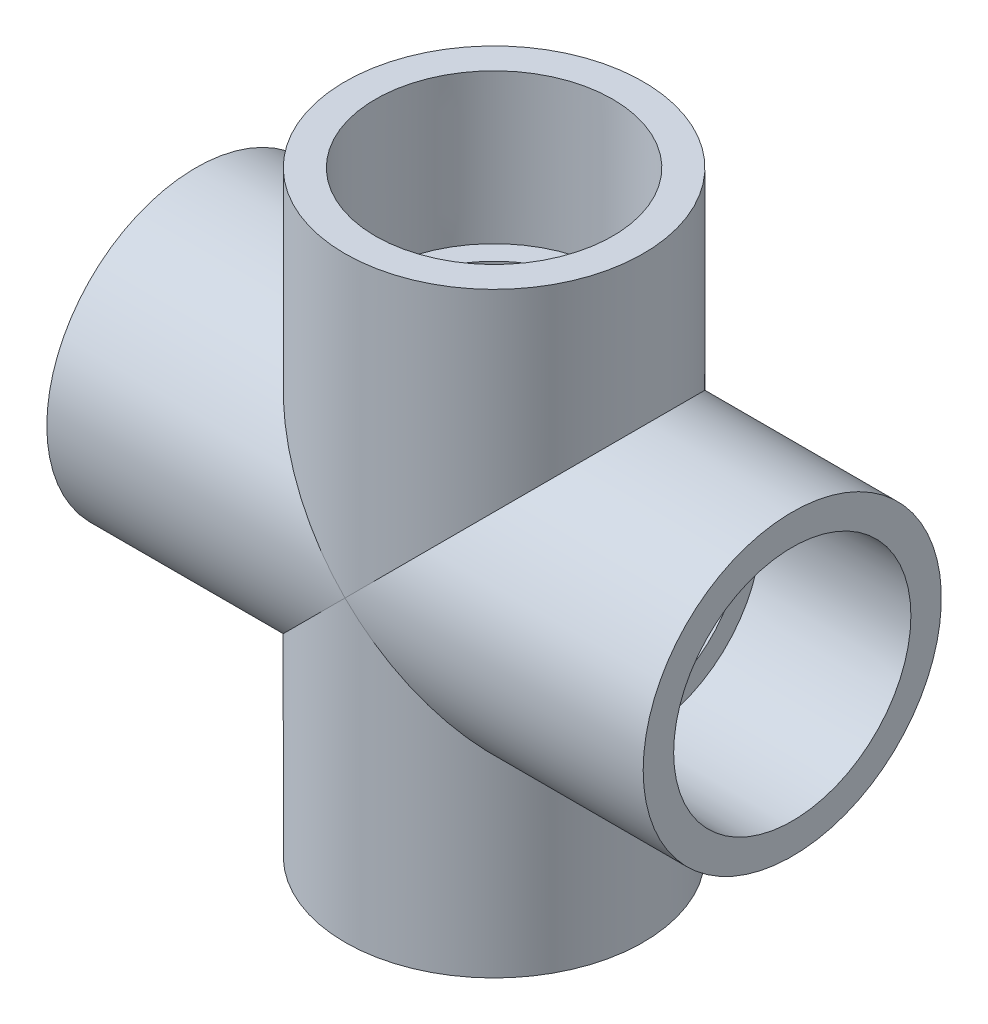
ISO-10303-21;
HEADER;
FILE_DESCRIPTION(('STEP AP214'),'2;1');
FILE_NAME('part.step','',(''),(''),'','','');
FILE_SCHEMA(('AUTOMOTIVE_DESIGN { 1 0 10303 214 1 1 1 1 }'));
ENDSEC;
DATA;
#1=APPLICATION_CONTEXT('core data for automotive mechanical design processes');
#2=APPLICATION_PROTOCOL_DEFINITION('international standard','automotive_design',2000,#1);
#3=PRODUCT_CONTEXT('',#1,'mechanical');
#4=PRODUCT('Part','Part','',(#3));
#5=PRODUCT_RELATED_PRODUCT_CATEGORY('part','',(#4));
#6=PRODUCT_DEFINITION_FORMATION('','',#4);
#7=PRODUCT_DEFINITION_CONTEXT('part definition',#1,'design');
#8=PRODUCT_DEFINITION('design','',#6,#7);
#9=PRODUCT_DEFINITION_SHAPE('','',#8);
#10=(LENGTH_UNIT() NAMED_UNIT(*) SI_UNIT(.MILLI.,.METRE.));
#11=(NAMED_UNIT(*) PLANE_ANGLE_UNIT() SI_UNIT($,.RADIAN.));
#12=(NAMED_UNIT(*) SI_UNIT($,.STERADIAN.) SOLID_ANGLE_UNIT());
#13=UNCERTAINTY_MEASURE_WITH_UNIT(LENGTH_MEASURE(1.E-05),#10,'distance_accuracy_value','');
#14=(GEOMETRIC_REPRESENTATION_CONTEXT(3) GLOBAL_UNCERTAINTY_ASSIGNED_CONTEXT((#13)) GLOBAL_UNIT_ASSIGNED_CONTEXT((#10,
#11,#12)) REPRESENTATION_CONTEXT('',''));
#15=CARTESIAN_POINT('',(0.,0.,0.));
#16=DIRECTION('',(0.,0.,1.));
#17=DIRECTION('',(1.,0.,0.));
#18=AXIS2_PLACEMENT_3D('',#15,#16,#17);
#19=CARTESIAN_POINT('',(-76.2,-38.1,0.));
#20=DIRECTION('',(-1.,0.,0.));
#21=DIRECTION('',(0.,0.,1.));
#22=AXIS2_PLACEMENT_3D('',#19,#20,#21);
#23=PLANE('',#22);
#24=CARTESIAN_POINT('',(-76.2,0.,0.));
#25=DIRECTION('',(-1.,0.,0.));
#26=DIRECTION('',(0.,0.,1.));
#27=AXIS2_PLACEMENT_3D('',#24,#25,#26);
#28=CIRCLE('',#27,38.1);
#29=CARTESIAN_POINT('',(-76.2,0.,38.1));
#30=VERTEX_POINT('',#29);
#31=EDGE_CURVE('E127',#30,#30,#28,.T.);
#32=ORIENTED_EDGE('',*,*,#31,.T.);
#33=EDGE_LOOP('',(#32));
#34=FACE_BOUND('',#33,.T.);
#35=CARTESIAN_POINT('',(-76.2,0.,0.));
#36=DIRECTION('',(-1.,0.,0.));
#37=DIRECTION('',(0.,0.,1.));
#38=AXIS2_PLACEMENT_3D('',#35,#36,#37);
#39=CIRCLE('',#38,30.3149);
#40=CARTESIAN_POINT('',(-76.2,0.,30.3149));
#41=VERTEX_POINT('',#40);
#42=EDGE_CURVE('E11',#41,#41,#39,.T.);
#43=ORIENTED_EDGE('',*,*,#42,.F.);
#44=EDGE_LOOP('',(#43));
#45=FACE_BOUND('',#44,.T.);
#46=ADVANCED_FACE('F34',(#34,#45),#23,.T.);
#47=CARTESIAN_POINT('',(-38.1,0.,0.));
#48=DIRECTION('',(-1.,0.,0.));
#49=DIRECTION('',(0.,0.,1.));
#50=AXIS2_PLACEMENT_3D('',#47,#48,#49);
#51=CONICAL_SURFACE('',#50,30.0863,0.00599992800155504);
#52=ORIENTED_EDGE('',*,*,#42,.T.);
#53=EDGE_LOOP('',(#52));
#54=FACE_BOUND('',#53,.T.);
#55=CARTESIAN_POINT('',(-38.1,0.,0.));
#56=DIRECTION('',(-1.,0.,0.));
#57=DIRECTION('',(0.,0.,1.));
#58=AXIS2_PLACEMENT_3D('',#55,#56,#57);
#59=CIRCLE('',#58,30.0863);
#60=CARTESIAN_POINT('',(-38.1,0.,30.0863));
#61=VERTEX_POINT('',#60);
#62=EDGE_CURVE('E41',#61,#61,#59,.T.);
#63=ORIENTED_EDGE('',*,*,#62,.F.);
#64=EDGE_LOOP('',(#63));
#65=FACE_BOUND('',#64,.T.);
#66=ADVANCED_FACE('F138',(#54,#65),#51,.F.);
#67=CARTESIAN_POINT('',(-38.1,-24.6253,0.));
#68=DIRECTION('',(-1.,0.,0.));
#69=DIRECTION('',(0.,0.,1.));
#70=AXIS2_PLACEMENT_3D('',#67,#68,#69);
#71=PLANE('',#70);
#72=ORIENTED_EDGE('',*,*,#62,.T.);
#73=EDGE_LOOP('',(#72));
#74=FACE_BOUND('',#73,.T.);
#75=CARTESIAN_POINT('',(-38.1,0.,0.));
#76=DIRECTION('',(-1.,0.,0.));
#77=DIRECTION('',(0.,0.,1.));
#78=AXIS2_PLACEMENT_3D('',#75,#76,#77);
#79=CIRCLE('',#78,24.6253);
#80=CARTESIAN_POINT('',(-38.1,0.,24.6253));
#81=VERTEX_POINT('',#80);
#82=EDGE_CURVE('E130',#81,#81,#79,.T.);
#83=ORIENTED_EDGE('',*,*,#82,.F.);
#84=EDGE_LOOP('',(#83));
#85=FACE_BOUND('',#84,.T.);
#86=ADVANCED_FACE('F135',(#74,#85),#71,.T.);
#87=CARTESIAN_POINT('',(-76.2,0.,0.));
#88=DIRECTION('',(-1.,0.,0.));
#89=DIRECTION('',(0.,0.,1.));
#90=AXIS2_PLACEMENT_3D('',#87,#88,#89);
#91=CYLINDRICAL_SURFACE('',#90,24.6253);
#92=CARTESIAN_POINT('',(0.,0.,0.));
#93=DIRECTION('',(0.70710678118655,-0.707106781186545,0.));
#94=DIRECTION('',(-0.707106781186545,-0.70710678118655,0.));
#95=AXIS2_PLACEMENT_3D('',#92,#93,#94);
#96=ELLIPSE('',#95,34.8254332375062,24.6253);
#97=CARTESIAN_POINT('',(0.,0.,24.6253));
#98=VERTEX_POINT('',#97);
#99=CARTESIAN_POINT('',(0.,0.,-24.6253));
#100=VERTEX_POINT('',#99);
#101=EDGE_CURVE('E59',#98,#100,#96,.T.);
#102=ORIENTED_EDGE('',*,*,#101,.T.);
#103=CARTESIAN_POINT('',(0.,0.,0.));
#104=DIRECTION('',(0.70710678118654,0.707106781186555,0.));
#105=DIRECTION('',(-0.707106781186555,0.70710678118654,0.));
#106=AXIS2_PLACEMENT_3D('',#103,#104,#105);
#107=ELLIPSE('',#106,34.8254332375062,24.6253);
#108=EDGE_CURVE('E47',#100,#98,#107,.T.);
#109=ORIENTED_EDGE('',*,*,#108,.T.);
#110=EDGE_LOOP('',(#102,#109));
#111=FACE_BOUND('',#110,.T.);
#112=ORIENTED_EDGE('',*,*,#82,.T.);
#113=EDGE_LOOP('',(#112));
#114=FACE_BOUND('',#113,.T.);
#115=ADVANCED_FACE('F61',(#111,#114),#91,.F.);
#116=CARTESIAN_POINT('',(-76.2,0.,0.));
#117=DIRECTION('',(-1.,0.,0.));
#118=DIRECTION('',(0.,0.,1.));
#119=AXIS2_PLACEMENT_3D('',#116,#117,#118);
#120=CYLINDRICAL_SURFACE('',#119,38.1);
#121=CARTESIAN_POINT('',(0.,0.,0.));
#122=DIRECTION('',(0.70710678118654,0.707106781186555,0.));
#123=DIRECTION('',(-0.707106781186555,0.70710678118654,0.));
#124=AXIS2_PLACEMENT_3D('',#121,#122,#123);
#125=ELLIPSE('',#124,53.8815367264149,38.1);
#126=CARTESIAN_POINT('',(0.,0.,38.1));
#127=VERTEX_POINT('',#126);
#128=CARTESIAN_POINT('',(0.,0.,-38.1));
#129=VERTEX_POINT('',#128);
#130=EDGE_CURVE('E54',#127,#129,#125,.F.);
#131=ORIENTED_EDGE('',*,*,#130,.T.);
#132=CARTESIAN_POINT('',(0.,0.,0.));
#133=DIRECTION('',(0.70710678118655,-0.707106781186545,0.));
#134=DIRECTION('',(-0.707106781186545,-0.70710678118655,0.));
#135=AXIS2_PLACEMENT_3D('',#132,#133,#134);
#136=ELLIPSE('',#135,53.8815367264149,38.1);
#137=EDGE_CURVE('E122',#129,#127,#136,.F.);
#138=ORIENTED_EDGE('',*,*,#137,.T.);
#139=EDGE_LOOP('',(#131,#138));
#140=FACE_BOUND('',#139,.T.);
#141=ORIENTED_EDGE('',*,*,#31,.F.);
#142=EDGE_LOOP('',(#141));
#143=FACE_BOUND('',#142,.T.);
#144=ADVANCED_FACE('F150',(#140,#143),#120,.T.);
#145=CARTESIAN_POINT('',(38.1000000000003,-76.1999999999998,0.));
#146=DIRECTION('',(0.,-1.,0.));
#147=DIRECTION('',(0.,0.,1.));
#148=AXIS2_PLACEMENT_3D('',#145,#146,#147);
#149=PLANE('',#148);
#150=CARTESIAN_POINT('',(2.66050878019847E-13,-76.2,0.));
#151=DIRECTION('',(0.,-1.,0.));
#152=DIRECTION('',(0.,0.,1.));
#153=AXIS2_PLACEMENT_3D('',#150,#151,#152);
#154=CIRCLE('',#153,38.1);
#155=CARTESIAN_POINT('',(2.66050878019847E-13,-76.2,38.1));
#156=VERTEX_POINT('',#155);
#157=EDGE_CURVE('E73',#156,#156,#154,.T.);
#158=ORIENTED_EDGE('',*,*,#157,.T.);
#159=EDGE_LOOP('',(#158));
#160=FACE_BOUND('',#159,.T.);
#161=CARTESIAN_POINT('',(2.66050878019847E-13,-76.2,0.));
#162=DIRECTION('',(0.,-1.,0.));
#163=DIRECTION('',(0.,0.,1.));
#164=AXIS2_PLACEMENT_3D('',#161,#162,#163);
#165=CIRCLE('',#164,30.3149);
#166=CARTESIAN_POINT('',(2.66050878019847E-13,-76.2,30.3149));
#167=VERTEX_POINT('',#166);
#168=EDGE_CURVE('E119',#167,#167,#165,.T.);
#169=ORIENTED_EDGE('',*,*,#168,.F.);
#170=EDGE_LOOP('',(#169));
#171=FACE_BOUND('',#170,.T.);
#172=ADVANCED_FACE('F153',(#160,#171),#149,.T.);
#173=CARTESIAN_POINT('',(1.33025439009923E-13,-38.1,0.));
#174=DIRECTION('',(0.,-1.,0.));
#175=DIRECTION('',(0.,0.,1.));
#176=AXIS2_PLACEMENT_3D('',#173,#174,#175);
#177=CONICAL_SURFACE('',#176,30.0863,0.00599992800155504);
#178=ORIENTED_EDGE('',*,*,#168,.T.);
#179=EDGE_LOOP('',(#178));
#180=FACE_BOUND('',#179,.T.);
#181=CARTESIAN_POINT('',(1.33025439009923E-13,-38.1,0.));
#182=DIRECTION('',(0.,-1.,0.));
#183=DIRECTION('',(0.,0.,1.));
#184=AXIS2_PLACEMENT_3D('',#181,#182,#183);
#185=CIRCLE('',#184,30.0863);
#186=CARTESIAN_POINT('',(1.33025439009923E-13,-38.1,30.0863));
#187=VERTEX_POINT('',#186);
#188=EDGE_CURVE('E116',#187,#187,#185,.T.);
#189=ORIENTED_EDGE('',*,*,#188,.F.);
#190=EDGE_LOOP('',(#189));
#191=FACE_BOUND('',#190,.T.);
#192=ADVANCED_FACE('F156',(#180,#191),#177,.F.);
#193=CARTESIAN_POINT('',(24.6253000000001,-38.0999999999999,0.));
#194=DIRECTION('',(0.,-1.,0.));
#195=DIRECTION('',(0.,0.,1.));
#196=AXIS2_PLACEMENT_3D('',#193,#194,#195);
#197=PLANE('',#196);
#198=ORIENTED_EDGE('',*,*,#188,.T.);
#199=EDGE_LOOP('',(#198));
#200=FACE_BOUND('',#199,.T.);
#201=CARTESIAN_POINT('',(1.33025439009923E-13,-38.1,0.));
#202=DIRECTION('',(0.,-1.,0.));
#203=DIRECTION('',(0.,0.,1.));
#204=AXIS2_PLACEMENT_3D('',#201,#202,#203);
#205=CIRCLE('',#204,24.6253);
#206=CARTESIAN_POINT('',(1.33025439009923E-13,-38.1,24.6253));
#207=VERTEX_POINT('',#206);
#208=EDGE_CURVE('E113',#207,#207,#205,.T.);
#209=ORIENTED_EDGE('',*,*,#208,.F.);
#210=EDGE_LOOP('',(#209));
#211=FACE_BOUND('',#210,.T.);
#212=ADVANCED_FACE('F160',(#200,#211),#197,.T.);
#213=CARTESIAN_POINT('',(2.66050878019847E-13,-76.2,0.));
#214=DIRECTION('',(0.,-1.,0.));
#215=DIRECTION('',(0.,0.,1.));
#216=AXIS2_PLACEMENT_3D('',#213,#214,#215);
#217=CYLINDRICAL_SURFACE('',#216,24.6253);
#218=CARTESIAN_POINT('',(0.,0.,0.));
#219=DIRECTION('',(-0.707106781186545,-0.70710678118655,0.));
#220=DIRECTION('',(0.70710678118655,-0.707106781186545,0.));
#221=AXIS2_PLACEMENT_3D('',#218,#219,#220);
#222=ELLIPSE('',#221,34.8254332375062,24.6253);
#223=EDGE_CURVE('E65',#100,#98,#222,.T.);
#224=ORIENTED_EDGE('',*,*,#223,.F.);
#225=ORIENTED_EDGE('',*,*,#101,.F.);
#226=EDGE_LOOP('',(#224,#225));
#227=FACE_BOUND('',#226,.T.);
#228=ORIENTED_EDGE('',*,*,#208,.T.);
#229=EDGE_LOOP('',(#228));
#230=FACE_BOUND('',#229,.T.);
#231=ADVANCED_FACE('F69',(#227,#230),#217,.F.);
#232=CARTESIAN_POINT('',(2.66050878019847E-13,-76.2,0.));
#233=DIRECTION('',(0.,-1.,0.));
#234=DIRECTION('',(0.,0.,1.));
#235=AXIS2_PLACEMENT_3D('',#232,#233,#234);
#236=CYLINDRICAL_SURFACE('',#235,38.1);
#237=ORIENTED_EDGE('',*,*,#137,.F.);
#238=CARTESIAN_POINT('',(0.,0.,0.));
#239=DIRECTION('',(-0.707106781186545,-0.70710678118655,0.));
#240=DIRECTION('',(0.70710678118655,-0.707106781186545,0.));
#241=AXIS2_PLACEMENT_3D('',#238,#239,#240);
#242=ELLIPSE('',#241,53.8815367264149,38.1);
#243=EDGE_CURVE('E124',#127,#129,#242,.F.);
#244=ORIENTED_EDGE('',*,*,#243,.F.);
#245=EDGE_LOOP('',(#237,#244));
#246=FACE_BOUND('',#245,.T.);
#247=ORIENTED_EDGE('',*,*,#157,.F.);
#248=EDGE_LOOP('',(#247));
#249=FACE_BOUND('',#248,.T.);
#250=ADVANCED_FACE('F167',(#246,#249),#236,.T.);
#251=CARTESIAN_POINT('',(76.2,38.1,0.));
#252=DIRECTION('',(1.,0.,0.));
#253=DIRECTION('',(0.,0.,1.));
#254=AXIS2_PLACEMENT_3D('',#251,#252,#253);
#255=PLANE('',#254);
#256=CARTESIAN_POINT('',(76.2,0.,0.));
#257=DIRECTION('',(1.,0.,0.));
#258=DIRECTION('',(0.,0.,1.));
#259=AXIS2_PLACEMENT_3D('',#256,#257,#258);
#260=CIRCLE('',#259,38.1);
#261=CARTESIAN_POINT('',(76.2,0.,38.1));
#262=VERTEX_POINT('',#261);
#263=EDGE_CURVE('E79',#262,#262,#260,.T.);
#264=ORIENTED_EDGE('',*,*,#263,.T.);
#265=EDGE_LOOP('',(#264));
#266=FACE_BOUND('',#265,.T.);
#267=CARTESIAN_POINT('',(76.2,0.,0.));
#268=DIRECTION('',(1.,0.,0.));
#269=DIRECTION('',(0.,0.,1.));
#270=AXIS2_PLACEMENT_3D('',#267,#268,#269);
#271=CIRCLE('',#270,30.3149);
#272=CARTESIAN_POINT('',(76.2,0.,30.3149));
#273=VERTEX_POINT('',#272);
#274=EDGE_CURVE('E106',#273,#273,#271,.T.);
#275=ORIENTED_EDGE('',*,*,#274,.F.);
#276=EDGE_LOOP('',(#275));
#277=FACE_BOUND('',#276,.T.);
#278=ADVANCED_FACE('F170',(#266,#277),#255,.T.);
#279=CARTESIAN_POINT('',(38.1,0.,0.));
#280=DIRECTION('',(1.,0.,0.));
#281=DIRECTION('',(0.,0.,1.));
#282=AXIS2_PLACEMENT_3D('',#279,#280,#281);
#283=CONICAL_SURFACE('',#282,30.0863,0.00599992800155504);
#284=ORIENTED_EDGE('',*,*,#274,.T.);
#285=EDGE_LOOP('',(#284));
#286=FACE_BOUND('',#285,.T.);
#287=CARTESIAN_POINT('',(38.1,0.,0.));
#288=DIRECTION('',(1.,0.,0.));
#289=DIRECTION('',(0.,0.,1.));
#290=AXIS2_PLACEMENT_3D('',#287,#288,#289);
#291=CIRCLE('',#290,30.0863);
#292=CARTESIAN_POINT('',(38.1,0.,30.0863));
#293=VERTEX_POINT('',#292);
#294=EDGE_CURVE('E103',#293,#293,#291,.T.);
#295=ORIENTED_EDGE('',*,*,#294,.F.);
#296=EDGE_LOOP('',(#295));
#297=FACE_BOUND('',#296,.T.);
#298=ADVANCED_FACE('F174',(#286,#297),#283,.F.);
#299=CARTESIAN_POINT('',(38.1,24.6253,0.));
#300=DIRECTION('',(1.,0.,0.));
#301=DIRECTION('',(0.,0.,1.));
#302=AXIS2_PLACEMENT_3D('',#299,#300,#301);
#303=PLANE('',#302);
#304=ORIENTED_EDGE('',*,*,#294,.T.);
#305=EDGE_LOOP('',(#304));
#306=FACE_BOUND('',#305,.T.);
#307=CARTESIAN_POINT('',(38.1,0.,0.));
#308=DIRECTION('',(1.,0.,0.));
#309=DIRECTION('',(0.,0.,1.));
#310=AXIS2_PLACEMENT_3D('',#307,#308,#309);
#311=CIRCLE('',#310,24.6253);
#312=CARTESIAN_POINT('',(38.1,0.,24.6253));
#313=VERTEX_POINT('',#312);
#314=EDGE_CURVE('E100',#313,#313,#311,.T.);
#315=ORIENTED_EDGE('',*,*,#314,.F.);
#316=EDGE_LOOP('',(#315));
#317=FACE_BOUND('',#316,.T.);
#318=ADVANCED_FACE('F178',(#306,#317),#303,.T.);
#319=CARTESIAN_POINT('',(76.2,0.,0.));
#320=DIRECTION('',(1.,0.,0.));
#321=DIRECTION('',(0.,0.,1.));
#322=AXIS2_PLACEMENT_3D('',#319,#320,#321);
#323=CYLINDRICAL_SURFACE('',#322,24.6253);
#324=CARTESIAN_POINT('',(0.,0.,0.));
#325=DIRECTION('',(0.707106781186547,-0.707106781186547,0.));
#326=DIRECTION('',(0.707106781186548,0.707106781186548,0.));
#327=AXIS2_PLACEMENT_3D('',#324,#325,#326);
#328=ELLIPSE('',#327,34.8254332375062,24.6253);
#329=EDGE_CURVE('E75',#100,#98,#328,.T.);
#330=ORIENTED_EDGE('',*,*,#329,.F.);
#331=ORIENTED_EDGE('',*,*,#223,.T.);
#332=EDGE_LOOP('',(#330,#331));
#333=FACE_BOUND('',#332,.T.);
#334=ORIENTED_EDGE('',*,*,#314,.T.);
#335=EDGE_LOOP('',(#334));
#336=FACE_BOUND('',#335,.T.);
#337=ADVANCED_FACE('F76',(#333,#336),#323,.F.);
#338=CARTESIAN_POINT('',(76.2,0.,0.));
#339=DIRECTION('',(1.,0.,0.));
#340=DIRECTION('',(0.,0.,1.));
#341=AXIS2_PLACEMENT_3D('',#338,#339,#340);
#342=CYLINDRICAL_SURFACE('',#341,38.1);
#343=ORIENTED_EDGE('',*,*,#243,.T.);
#344=CARTESIAN_POINT('',(0.,0.,0.));
#345=DIRECTION('',(0.707106781186547,-0.707106781186547,0.));
#346=DIRECTION('',(0.707106781186548,0.707106781186548,0.));
#347=AXIS2_PLACEMENT_3D('',#344,#345,#346);
#348=ELLIPSE('',#347,53.8815367264149,38.1);
#349=EDGE_CURVE('E66',#127,#129,#348,.F.);
#350=ORIENTED_EDGE('',*,*,#349,.F.);
#351=EDGE_LOOP('',(#343,#350));
#352=FACE_BOUND('',#351,.T.);
#353=ORIENTED_EDGE('',*,*,#263,.F.);
#354=EDGE_LOOP('',(#353));
#355=FACE_BOUND('',#354,.T.);
#356=ADVANCED_FACE('F185',(#352,#355),#342,.T.);
#357=CARTESIAN_POINT('',(-38.1000000000008,76.1999999999996,0.));
#358=DIRECTION('',(0.,1.,0.));
#359=DIRECTION('',(0.,0.,1.));
#360=AXIS2_PLACEMENT_3D('',#357,#358,#359);
#361=PLANE('',#360);
#362=CARTESIAN_POINT('',(-7.9815263405954E-13,76.2,0.));
#363=DIRECTION('',(0.,1.,0.));
#364=DIRECTION('',(0.,0.,1.));
#365=AXIS2_PLACEMENT_3D('',#362,#363,#364);
#366=CIRCLE('',#365,38.1);
#367=CARTESIAN_POINT('',(-7.9815263405954E-13,76.2,38.1));
#368=VERTEX_POINT('',#367);
#369=EDGE_CURVE('E83',#368,#368,#366,.T.);
#370=ORIENTED_EDGE('',*,*,#369,.T.);
#371=EDGE_LOOP('',(#370));
#372=FACE_BOUND('',#371,.T.);
#373=CARTESIAN_POINT('',(-7.9815263405954E-13,76.2,0.));
#374=DIRECTION('',(0.,1.,0.));
#375=DIRECTION('',(0.,0.,1.));
#376=AXIS2_PLACEMENT_3D('',#373,#374,#375);
#377=CIRCLE('',#376,30.3149);
#378=CARTESIAN_POINT('',(-7.9815263405954E-13,76.2,30.3149));
#379=VERTEX_POINT('',#378);
#380=EDGE_CURVE('E94',#379,#379,#377,.T.);
#381=ORIENTED_EDGE('',*,*,#380,.F.);
#382=EDGE_LOOP('',(#381));
#383=FACE_BOUND('',#382,.T.);
#384=ADVANCED_FACE('F188',(#372,#383),#361,.T.);
#385=CARTESIAN_POINT('',(-3.9907631702977E-13,38.1,0.));
#386=DIRECTION('',(0.,1.,0.));
#387=DIRECTION('',(0.,0.,1.));
#388=AXIS2_PLACEMENT_3D('',#385,#386,#387);
#389=CONICAL_SURFACE('',#388,30.0863,0.00599992800155504);
#390=ORIENTED_EDGE('',*,*,#380,.T.);
#391=EDGE_LOOP('',(#390));
#392=FACE_BOUND('',#391,.T.);
#393=CARTESIAN_POINT('',(-3.9907631702977E-13,38.1,0.));
#394=DIRECTION('',(0.,1.,0.));
#395=DIRECTION('',(0.,0.,1.));
#396=AXIS2_PLACEMENT_3D('',#393,#394,#395);
#397=CIRCLE('',#396,30.0863);
#398=CARTESIAN_POINT('',(-3.9907631702977E-13,38.1,30.0863));
#399=VERTEX_POINT('',#398);
#400=EDGE_CURVE('E91',#399,#399,#397,.T.);
#401=ORIENTED_EDGE('',*,*,#400,.F.);
#402=EDGE_LOOP('',(#401));
#403=FACE_BOUND('',#402,.T.);
#404=ADVANCED_FACE('F192',(#392,#403),#389,.F.);
#405=CARTESIAN_POINT('',(-24.6253000000004,38.0999999999997,0.));
#406=DIRECTION('',(0.,1.,0.));
#407=DIRECTION('',(0.,0.,1.));
#408=AXIS2_PLACEMENT_3D('',#405,#406,#407);
#409=PLANE('',#408);
#410=ORIENTED_EDGE('',*,*,#400,.T.);
#411=EDGE_LOOP('',(#410));
#412=FACE_BOUND('',#411,.T.);
#413=CARTESIAN_POINT('',(-3.9907631702977E-13,38.1,0.));
#414=DIRECTION('',(0.,1.,0.));
#415=DIRECTION('',(0.,0.,1.));
#416=AXIS2_PLACEMENT_3D('',#413,#414,#415);
#417=CIRCLE('',#416,24.6253);
#418=CARTESIAN_POINT('',(-3.9907631702977E-13,38.1,24.6253));
#419=VERTEX_POINT('',#418);
#420=EDGE_CURVE('E86',#419,#419,#417,.T.);
#421=ORIENTED_EDGE('',*,*,#420,.F.);
#422=EDGE_LOOP('',(#421));
#423=FACE_BOUND('',#422,.T.);
#424=ADVANCED_FACE('F196',(#412,#423),#409,.T.);
#425=CARTESIAN_POINT('',(-7.9815263405954E-13,76.2,0.));
#426=DIRECTION('',(0.,1.,0.));
#427=DIRECTION('',(0.,0.,1.));
#428=AXIS2_PLACEMENT_3D('',#425,#426,#427);
#429=CYLINDRICAL_SURFACE('',#428,24.6253);
#430=ORIENTED_EDGE('',*,*,#108,.F.);
#431=ORIENTED_EDGE('',*,*,#329,.T.);
#432=EDGE_LOOP('',(#430,#431));
#433=FACE_BOUND('',#432,.T.);
#434=ORIENTED_EDGE('',*,*,#420,.T.);
#435=EDGE_LOOP('',(#434));
#436=FACE_BOUND('',#435,.T.);
#437=ADVANCED_FACE('F81',(#433,#436),#429,.F.);
#438=CARTESIAN_POINT('',(-7.9815263405954E-13,76.2,0.));
#439=DIRECTION('',(0.,1.,0.));
#440=DIRECTION('',(0.,0.,1.));
#441=AXIS2_PLACEMENT_3D('',#438,#439,#440);
#442=CYLINDRICAL_SURFACE('',#441,38.1);
#443=ORIENTED_EDGE('',*,*,#349,.T.);
#444=ORIENTED_EDGE('',*,*,#130,.F.);
#445=EDGE_LOOP('',(#443,#444));
#446=FACE_BOUND('',#445,.T.);
#447=ORIENTED_EDGE('',*,*,#369,.F.);
#448=EDGE_LOOP('',(#447));
#449=FACE_BOUND('',#448,.T.);
#450=ADVANCED_FACE('F203',(#446,#449),#442,.T.);
#451=CLOSED_SHELL('',(#46,#66,#86,#115,#144,#172,#192,#212,#231,#250,#278,#298,#318,#337,#356,
#384,#404,#424,#437,#450));
#452=MANIFOLD_SOLID_BREP('B2',#451);
#453=ADVANCED_BREP_SHAPE_REPRESENTATION('',(#18,#452),#14);
#454=SHAPE_DEFINITION_REPRESENTATION(#9,#453);
ENDSEC;
END-ISO-10303-21;
